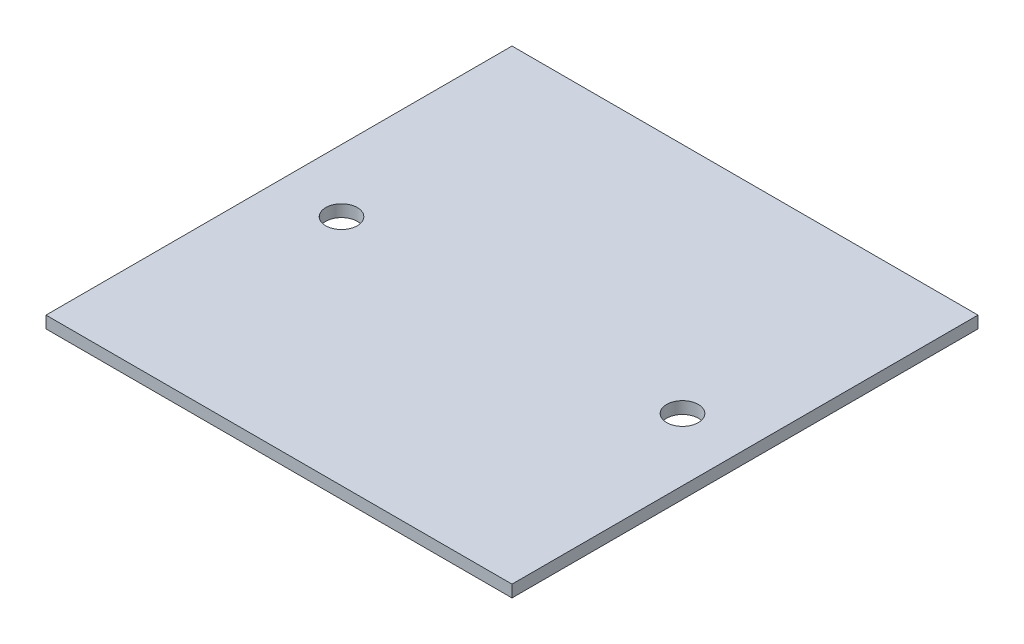
ISO-10303-21;
HEADER;
FILE_DESCRIPTION(('STEP AP214'),'2;1');
FILE_NAME('part.step','',(''),(''),'','','');
FILE_SCHEMA(('AUTOMOTIVE_DESIGN { 1 0 10303 214 1 1 1 1 }'));
ENDSEC;
DATA;
#1=APPLICATION_CONTEXT('core data for automotive mechanical design processes');
#2=APPLICATION_PROTOCOL_DEFINITION('international standard','automotive_design',2000,#1);
#3=PRODUCT_CONTEXT('',#1,'mechanical');
#4=PRODUCT('Part','Part','',(#3));
#5=PRODUCT_RELATED_PRODUCT_CATEGORY('part','',(#4));
#6=PRODUCT_DEFINITION_FORMATION('','',#4);
#7=PRODUCT_DEFINITION_CONTEXT('part definition',#1,'design');
#8=PRODUCT_DEFINITION('design','',#6,#7);
#9=PRODUCT_DEFINITION_SHAPE('','',#8);
#10=(LENGTH_UNIT() NAMED_UNIT(*) SI_UNIT(.MILLI.,.METRE.));
#11=(NAMED_UNIT(*) PLANE_ANGLE_UNIT() SI_UNIT($,.RADIAN.));
#12=(NAMED_UNIT(*) SI_UNIT($,.STERADIAN.) SOLID_ANGLE_UNIT());
#13=UNCERTAINTY_MEASURE_WITH_UNIT(LENGTH_MEASURE(1.E-05),#10,'distance_accuracy_value','');
#14=(GEOMETRIC_REPRESENTATION_CONTEXT(3) GLOBAL_UNCERTAINTY_ASSIGNED_CONTEXT((#13)) GLOBAL_UNIT_ASSIGNED_CONTEXT((#10,
#11,#12)) REPRESENTATION_CONTEXT('',''));
#15=CARTESIAN_POINT('',(0.,0.,0.));
#16=DIRECTION('',(0.,0.,1.));
#17=DIRECTION('',(1.,0.,0.));
#18=AXIS2_PLACEMENT_3D('',#15,#16,#17);
#19=CARTESIAN_POINT('',(36.9,1.9,-36.9));
#20=DIRECTION('',(-1.,0.,0.));
#21=DIRECTION('',(0.,0.,1.));
#22=AXIS2_PLACEMENT_3D('',#19,#20,#21);
#23=PLANE('',#22);
#24=DIRECTION('',(0.,0.,-1.));
#25=VECTOR('',#24,1.);
#26=CARTESIAN_POINT('',(36.9,0.,-36.9));
#27=LINE('',#26,#25);
#28=CARTESIAN_POINT('',(36.9,0.,36.9));
#29=VERTEX_POINT('',#28);
#30=CARTESIAN_POINT('',(36.9,0.,-36.9));
#31=VERTEX_POINT('',#30);
#32=EDGE_CURVE('E111',#29,#31,#27,.T.);
#33=ORIENTED_EDGE('',*,*,#32,.T.);
#34=DIRECTION('',(0.,-1.,0.));
#35=VECTOR('',#34,1.);
#36=CARTESIAN_POINT('',(36.9,1.9,-36.9));
#37=LINE('',#36,#35);
#38=CARTESIAN_POINT('',(36.9,1.9,-36.9));
#39=VERTEX_POINT('',#38);
#40=EDGE_CURVE('E11',#39,#31,#37,.T.);
#41=ORIENTED_EDGE('',*,*,#40,.F.);
#42=DIRECTION('',(0.,0.,-1.));
#43=VECTOR('',#42,1.);
#44=CARTESIAN_POINT('',(36.9,1.9,-36.9));
#45=LINE('',#44,#43);
#46=CARTESIAN_POINT('',(36.9,1.9,36.9));
#47=VERTEX_POINT('',#46);
#48=EDGE_CURVE('E95',#47,#39,#45,.T.);
#49=ORIENTED_EDGE('',*,*,#48,.F.);
#50=DIRECTION('',(0.,-1.,0.));
#51=VECTOR('',#50,1.);
#52=CARTESIAN_POINT('',(36.9,1.9,36.9));
#53=LINE('',#52,#51);
#54=EDGE_CURVE('E107',#47,#29,#53,.T.);
#55=ORIENTED_EDGE('',*,*,#54,.T.);
#56=EDGE_LOOP('',(#33,#41,#49,#55));
#57=FACE_BOUND('',#56,.T.);
#58=ADVANCED_FACE('F43',(#57),#23,.F.);
#59=CARTESIAN_POINT('',(-36.9,1.9,-36.9));
#60=DIRECTION('',(0.,0.,1.));
#61=DIRECTION('',(1.,0.,0.));
#62=AXIS2_PLACEMENT_3D('',#59,#60,#61);
#63=PLANE('',#62);
#64=DIRECTION('',(-1.,0.,0.));
#65=VECTOR('',#64,1.);
#66=CARTESIAN_POINT('',(-36.9,0.,-36.9));
#67=LINE('',#66,#65);
#68=CARTESIAN_POINT('',(-36.9,0.,-36.9));
#69=VERTEX_POINT('',#68);
#70=EDGE_CURVE('E100',#31,#69,#67,.T.);
#71=ORIENTED_EDGE('',*,*,#70,.T.);
#72=DIRECTION('',(0.,-1.,0.));
#73=VECTOR('',#72,1.);
#74=CARTESIAN_POINT('',(-36.9,1.9,-36.9));
#75=LINE('',#74,#73);
#76=CARTESIAN_POINT('',(-36.9,1.9,-36.9));
#77=VERTEX_POINT('',#76);
#78=EDGE_CURVE('E52',#77,#69,#75,.T.);
#79=ORIENTED_EDGE('',*,*,#78,.F.);
#80=DIRECTION('',(-1.,0.,0.));
#81=VECTOR('',#80,1.);
#82=CARTESIAN_POINT('',(-36.9,1.9,-36.9));
#83=LINE('',#82,#81);
#84=EDGE_CURVE('E90',#39,#77,#83,.T.);
#85=ORIENTED_EDGE('',*,*,#84,.F.);
#86=ORIENTED_EDGE('',*,*,#40,.T.);
#87=EDGE_LOOP('',(#71,#79,#85,#86));
#88=FACE_BOUND('',#87,.T.);
#89=ADVANCED_FACE('F99',(#88),#63,.F.);
#90=CARTESIAN_POINT('',(-36.9,1.9,-36.9));
#91=DIRECTION('',(1.,0.,0.));
#92=DIRECTION('',(0.,0.,-1.));
#93=AXIS2_PLACEMENT_3D('',#90,#91,#92);
#94=PLANE('',#93);
#95=DIRECTION('',(0.,0.,1.));
#96=VECTOR('',#95,1.);
#97=CARTESIAN_POINT('',(-36.9,0.,-36.9));
#98=LINE('',#97,#96);
#99=CARTESIAN_POINT('',(-36.9,0.,36.9));
#100=VERTEX_POINT('',#99);
#101=EDGE_CURVE('E77',#69,#100,#98,.T.);
#102=ORIENTED_EDGE('',*,*,#101,.T.);
#103=DIRECTION('',(0.,-1.,0.));
#104=VECTOR('',#103,1.);
#105=CARTESIAN_POINT('',(-36.9,1.9,36.9));
#106=LINE('',#105,#104);
#107=CARTESIAN_POINT('',(-36.9,1.9,36.9));
#108=VERTEX_POINT('',#107);
#109=EDGE_CURVE('E102',#108,#100,#106,.T.);
#110=ORIENTED_EDGE('',*,*,#109,.F.);
#111=DIRECTION('',(0.,0.,1.));
#112=VECTOR('',#111,1.);
#113=CARTESIAN_POINT('',(-36.9,1.9,-36.9));
#114=LINE('',#113,#112);
#115=EDGE_CURVE('E93',#77,#108,#114,.T.);
#116=ORIENTED_EDGE('',*,*,#115,.F.);
#117=ORIENTED_EDGE('',*,*,#78,.T.);
#118=EDGE_LOOP('',(#102,#110,#116,#117));
#119=FACE_BOUND('',#118,.T.);
#120=ADVANCED_FACE('F103',(#119),#94,.F.);
#121=CARTESIAN_POINT('',(-36.9,1.9,36.9));
#122=DIRECTION('',(0.,0.,-1.));
#123=DIRECTION('',(-1.,0.,0.));
#124=AXIS2_PLACEMENT_3D('',#121,#122,#123);
#125=PLANE('',#124);
#126=DIRECTION('',(1.,0.,0.));
#127=VECTOR('',#126,1.);
#128=CARTESIAN_POINT('',(-36.9,0.,36.9));
#129=LINE('',#128,#127);
#130=EDGE_CURVE('E83',#100,#29,#129,.T.);
#131=ORIENTED_EDGE('',*,*,#130,.T.);
#132=ORIENTED_EDGE('',*,*,#54,.F.);
#133=DIRECTION('',(1.,0.,0.));
#134=VECTOR('',#133,1.);
#135=CARTESIAN_POINT('',(-36.9,1.9,36.9));
#136=LINE('',#135,#134);
#137=EDGE_CURVE('E60',#108,#47,#136,.T.);
#138=ORIENTED_EDGE('',*,*,#137,.F.);
#139=ORIENTED_EDGE('',*,*,#109,.T.);
#140=EDGE_LOOP('',(#131,#132,#138,#139));
#141=FACE_BOUND('',#140,.T.);
#142=ADVANCED_FACE('F125',(#141),#125,.F.);
#143=CARTESIAN_POINT('',(0.,1.9,0.));
#144=DIRECTION('',(0.,1.,0.));
#145=DIRECTION('',(0.,0.,1.));
#146=AXIS2_PLACEMENT_3D('',#143,#144,#145);
#147=PLANE('',#146);
#148=CARTESIAN_POINT('',(-27.,1.9,0.));
#149=DIRECTION('',(0.,1.,0.));
#150=DIRECTION('',(0.,0.,1.));
#151=AXIS2_PLACEMENT_3D('',#148,#149,#150);
#152=CIRCLE('',#151,2.5);
#153=CARTESIAN_POINT('',(-27.,1.9,2.50000000000001));
#154=VERTEX_POINT('',#153);
#155=EDGE_CURVE('E140',#154,#154,#152,.T.);
#156=ORIENTED_EDGE('',*,*,#155,.F.);
#157=EDGE_LOOP('',(#156));
#158=FACE_BOUND('',#157,.T.);
#159=CARTESIAN_POINT('',(27.,1.9,0.));
#160=DIRECTION('',(0.,1.,0.));
#161=DIRECTION('',(0.,0.,-1.));
#162=AXIS2_PLACEMENT_3D('',#159,#160,#161);
#163=CIRCLE('',#162,2.5);
#164=CARTESIAN_POINT('',(27.,1.9,-2.49999999999999));
#165=VERTEX_POINT('',#164);
#166=EDGE_CURVE('E136',#165,#165,#163,.T.);
#167=ORIENTED_EDGE('',*,*,#166,.F.);
#168=EDGE_LOOP('',(#167));
#169=FACE_BOUND('',#168,.T.);
#170=ORIENTED_EDGE('',*,*,#48,.T.);
#171=ORIENTED_EDGE('',*,*,#84,.T.);
#172=ORIENTED_EDGE('',*,*,#115,.T.);
#173=ORIENTED_EDGE('',*,*,#137,.T.);
#174=EDGE_LOOP('',(#170,#171,#172,#173));
#175=FACE_BOUND('',#174,.T.);
#176=ADVANCED_FACE('F91',(#158,#169,#175),#147,.T.);
#177=CARTESIAN_POINT('',(0.,0.,0.));
#178=DIRECTION('',(0.,1.,0.));
#179=DIRECTION('',(0.,0.,1.));
#180=AXIS2_PLACEMENT_3D('',#177,#178,#179);
#181=PLANE('',#180);
#182=CARTESIAN_POINT('',(-27.,0.,0.));
#183=DIRECTION('',(0.,1.,0.));
#184=DIRECTION('',(0.,0.,1.));
#185=AXIS2_PLACEMENT_3D('',#182,#183,#184);
#186=CIRCLE('',#185,2.5);
#187=CARTESIAN_POINT('',(-27.,0.,2.50000000000001));
#188=VERTEX_POINT('',#187);
#189=EDGE_CURVE('E115',#188,#188,#186,.T.);
#190=ORIENTED_EDGE('',*,*,#189,.T.);
#191=EDGE_LOOP('',(#190));
#192=FACE_BOUND('',#191,.T.);
#193=CARTESIAN_POINT('',(27.,0.,0.));
#194=DIRECTION('',(0.,1.,0.));
#195=DIRECTION('',(0.,0.,-1.));
#196=AXIS2_PLACEMENT_3D('',#193,#194,#195);
#197=CIRCLE('',#196,2.5);
#198=CARTESIAN_POINT('',(27.,0.,-2.49999999999999));
#199=VERTEX_POINT('',#198);
#200=EDGE_CURVE('E132',#199,#199,#197,.T.);
#201=ORIENTED_EDGE('',*,*,#200,.T.);
#202=EDGE_LOOP('',(#201));
#203=FACE_BOUND('',#202,.T.);
#204=ORIENTED_EDGE('',*,*,#32,.F.);
#205=ORIENTED_EDGE('',*,*,#130,.F.);
#206=ORIENTED_EDGE('',*,*,#101,.F.);
#207=ORIENTED_EDGE('',*,*,#70,.F.);
#208=EDGE_LOOP('',(#204,#205,#206,#207));
#209=FACE_BOUND('',#208,.T.);
#210=ADVANCED_FACE('F128',(#192,#203,#209),#181,.F.);
#211=CARTESIAN_POINT('',(27.,0.,0.));
#212=DIRECTION('',(0.,1.,0.));
#213=DIRECTION('',(0.,0.,1.));
#214=AXIS2_PLACEMENT_3D('',#211,#212,#213);
#215=CYLINDRICAL_SURFACE('',#214,2.5);
#216=ORIENTED_EDGE('',*,*,#200,.F.);
#217=EDGE_LOOP('',(#216));
#218=FACE_BOUND('',#217,.T.);
#219=ORIENTED_EDGE('',*,*,#166,.T.);
#220=EDGE_LOOP('',(#219));
#221=FACE_BOUND('',#220,.T.);
#222=ADVANCED_FACE('F153',(#218,#221),#215,.F.);
#223=CARTESIAN_POINT('',(-27.,0.,0.));
#224=DIRECTION('',(0.,1.,0.));
#225=DIRECTION('',(0.,0.,1.));
#226=AXIS2_PLACEMENT_3D('',#223,#224,#225);
#227=CYLINDRICAL_SURFACE('',#226,2.5);
#228=ORIENTED_EDGE('',*,*,#189,.F.);
#229=EDGE_LOOP('',(#228));
#230=FACE_BOUND('',#229,.T.);
#231=ORIENTED_EDGE('',*,*,#155,.T.);
#232=EDGE_LOOP('',(#231));
#233=FACE_BOUND('',#232,.T.);
#234=ADVANCED_FACE('F150',(#230,#233),#227,.F.);
#235=CLOSED_SHELL('',(#58,#89,#120,#142,#176,#210,#222,#234));
#236=MANIFOLD_SOLID_BREP('B2',#235);
#237=ADVANCED_BREP_SHAPE_REPRESENTATION('',(#18,#236),#14);
#238=SHAPE_DEFINITION_REPRESENTATION(#9,#237);
ENDSEC;
END-ISO-10303-21;
